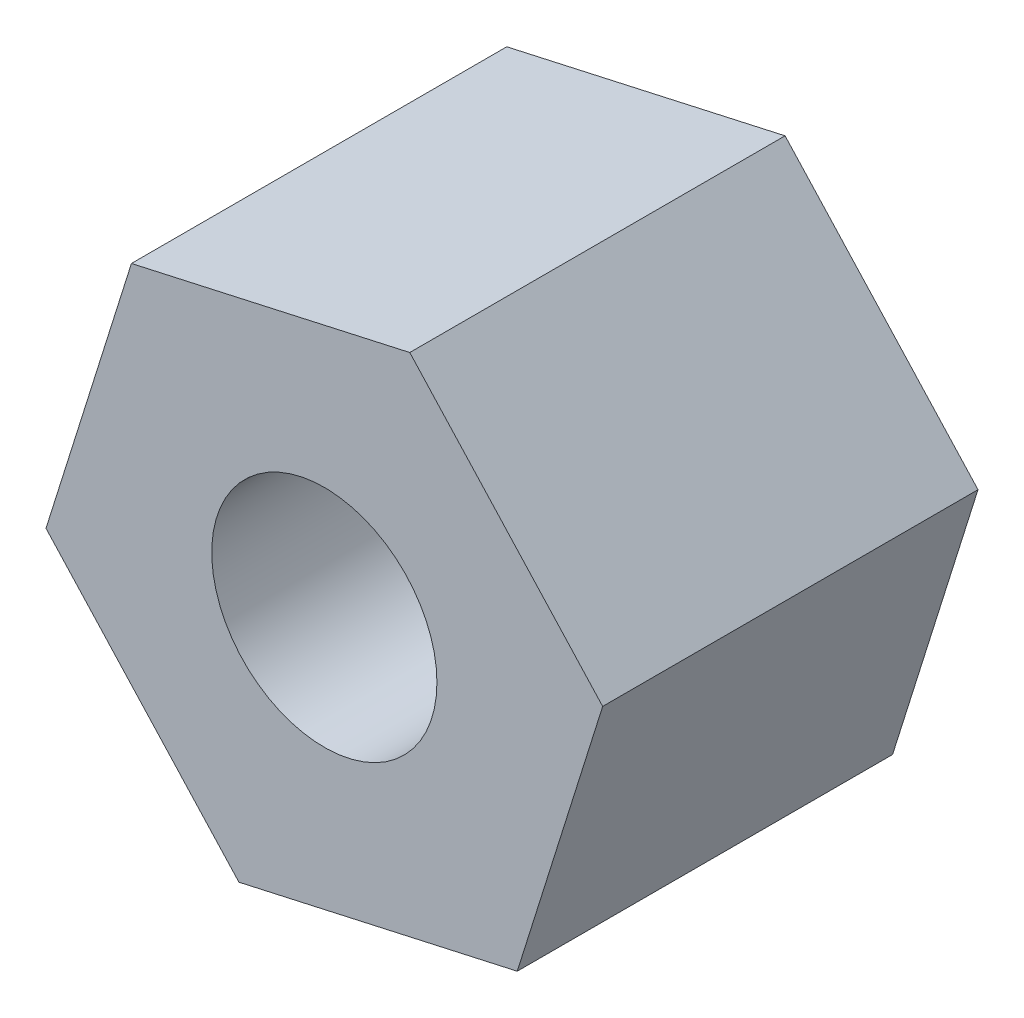
ISO-10303-21;
HEADER;
FILE_DESCRIPTION(('STEP AP214'),'2;1');
FILE_NAME('part.step','',(''),(''),'','','');
FILE_SCHEMA(('AUTOMOTIVE_DESIGN { 1 0 10303 214 1 1 1 1 }'));
ENDSEC;
DATA;
#1=APPLICATION_CONTEXT('core data for automotive mechanical design processes');
#2=APPLICATION_PROTOCOL_DEFINITION('international standard','automotive_design',2000,#1);
#3=PRODUCT_CONTEXT('',#1,'mechanical');
#4=PRODUCT('Part','Part','',(#3));
#5=PRODUCT_RELATED_PRODUCT_CATEGORY('part','',(#4));
#6=PRODUCT_DEFINITION_FORMATION('','',#4);
#7=PRODUCT_DEFINITION_CONTEXT('part definition',#1,'design');
#8=PRODUCT_DEFINITION('design','',#6,#7);
#9=PRODUCT_DEFINITION_SHAPE('','',#8);
#10=(LENGTH_UNIT() NAMED_UNIT(*) SI_UNIT(.MILLI.,.METRE.));
#11=(NAMED_UNIT(*) PLANE_ANGLE_UNIT() SI_UNIT($,.RADIAN.));
#12=(NAMED_UNIT(*) SI_UNIT($,.STERADIAN.) SOLID_ANGLE_UNIT());
#13=UNCERTAINTY_MEASURE_WITH_UNIT(LENGTH_MEASURE(1.E-05),#10,'distance_accuracy_value','');
#14=(GEOMETRIC_REPRESENTATION_CONTEXT(3) GLOBAL_UNCERTAINTY_ASSIGNED_CONTEXT((#13)) GLOBAL_UNIT_ASSIGNED_CONTEXT((#10,
#11,#12)) REPRESENTATION_CONTEXT('',''));
#15=CARTESIAN_POINT('',(0.,0.,0.));
#16=DIRECTION('',(0.,0.,1.));
#17=DIRECTION('',(1.,0.,0.));
#18=AXIS2_PLACEMENT_3D('',#15,#16,#17);
#19=CARTESIAN_POINT('',(0.,0.,5.));
#20=DIRECTION('',(0.,0.,1.));
#21=DIRECTION('',(1.,0.,0.));
#22=AXIS2_PLACEMENT_3D('',#19,#20,#21);
#23=PLANE('',#22);
#24=DIRECTION('',(-0.676465616289727,0.736474215419494,0.));
#25=VECTOR('',#24,1.);
#26=CARTESIAN_POINT('',(3.70793469135943,0.826652077930349,5.));
#27=LINE('',#26,#25);
#28=CARTESIAN_POINT('',(3.70793469135943,0.826652077930349,5.));
#29=VERTEX_POINT('',#28);
#30=CARTESIAN_POINT('',(1.13806564610084,3.62449167725606,5.));
#31=VERTEX_POINT('',#30);
#32=EDGE_CURVE('E146',#29,#31,#27,.T.);
#33=ORIENTED_EDGE('',*,*,#32,.T.);
#34=DIRECTION('',(-0.976038187930359,-0.217599300783853,0.));
#35=VECTOR('',#34,1.);
#36=CARTESIAN_POINT('',(1.13806564610084,3.62449167725606,5.));
#37=LINE('',#36,#35);
#38=CARTESIAN_POINT('',(-2.56986904525859,2.79783959932571,5.));
#39=VERTEX_POINT('',#38);
#40=EDGE_CURVE('E94',#31,#39,#37,.T.);
#41=ORIENTED_EDGE('',*,*,#40,.T.);
#42=DIRECTION('',(-0.299572571640632,-0.954073516203347,0.));
#43=VECTOR('',#42,1.);
#44=CARTESIAN_POINT('',(-2.56986904525859,2.79783959932571,5.));
#45=LINE('',#44,#43);
#46=CARTESIAN_POINT('',(-3.70793469135943,-0.826652077930349,5.));
#47=VERTEX_POINT('',#46);
#48=EDGE_CURVE('E107',#39,#47,#45,.T.);
#49=ORIENTED_EDGE('',*,*,#48,.T.);
#50=DIRECTION('',(0.676465616289727,-0.736474215419494,0.));
#51=VECTOR('',#50,1.);
#52=CARTESIAN_POINT('',(-3.70793469135943,-0.826652077930349,5.));
#53=LINE('',#52,#51);
#54=CARTESIAN_POINT('',(-1.13806564610084,-3.62449167725606,5.));
#55=VERTEX_POINT('',#54);
#56=EDGE_CURVE('E101',#47,#55,#53,.T.);
#57=ORIENTED_EDGE('',*,*,#56,.T.);
#58=DIRECTION('',(0.976038187930359,0.217599300783853,0.));
#59=VECTOR('',#58,1.);
#60=CARTESIAN_POINT('',(-1.13806564610084,-3.62449167725606,5.));
#61=LINE('',#60,#59);
#62=CARTESIAN_POINT('',(2.56986904525859,-2.79783959932571,5.));
#63=VERTEX_POINT('',#62);
#64=EDGE_CURVE('E105',#55,#63,#61,.T.);
#65=ORIENTED_EDGE('',*,*,#64,.T.);
#66=DIRECTION('',(0.299572571640632,0.954073516203347,0.));
#67=VECTOR('',#66,1.);
#68=CARTESIAN_POINT('',(2.56986904525859,-2.79783959932571,5.));
#69=LINE('',#68,#67);
#70=EDGE_CURVE('E57',#63,#29,#69,.T.);
#71=ORIENTED_EDGE('',*,*,#70,.T.);
#72=EDGE_LOOP('',(#33,#41,#49,#57,#65,#71));
#73=FACE_BOUND('',#72,.T.);
#74=CARTESIAN_POINT('',(0.,0.,5.));
#75=DIRECTION('',(0.,0.,1.));
#76=DIRECTION('',(1.,0.,0.));
#77=AXIS2_PLACEMENT_3D('',#74,#75,#76);
#78=CIRCLE('',#77,1.5);
#79=CARTESIAN_POINT('',(1.5,0.,5.));
#80=VERTEX_POINT('',#79);
#81=EDGE_CURVE('E134',#80,#80,#78,.T.);
#82=ORIENTED_EDGE('',*,*,#81,.F.);
#83=EDGE_LOOP('',(#82));
#84=FACE_BOUND('',#83,.T.);
#85=ADVANCED_FACE('F39',(#73,#84),#23,.T.);
#86=CARTESIAN_POINT('',(0.,0.,0.));
#87=DIRECTION('',(0.,0.,1.));
#88=DIRECTION('',(1.,0.,0.));
#89=AXIS2_PLACEMENT_3D('',#86,#87,#88);
#90=PLANE('',#89);
#91=DIRECTION('',(-0.676465616289727,0.736474215419494,0.));
#92=VECTOR('',#91,1.);
#93=CARTESIAN_POINT('',(3.70793469135943,0.826652077930349,0.));
#94=LINE('',#93,#92);
#95=CARTESIAN_POINT('',(3.70793469135943,0.826652077930349,0.));
#96=VERTEX_POINT('',#95);
#97=CARTESIAN_POINT('',(1.13806564610084,3.62449167725606,0.));
#98=VERTEX_POINT('',#97);
#99=EDGE_CURVE('E129',#96,#98,#94,.T.);
#100=ORIENTED_EDGE('',*,*,#99,.F.);
#101=DIRECTION('',(0.299572571640632,0.954073516203347,0.));
#102=VECTOR('',#101,1.);
#103=CARTESIAN_POINT('',(2.56986904525859,-2.79783959932571,0.));
#104=LINE('',#103,#102);
#105=CARTESIAN_POINT('',(2.56986904525859,-2.79783959932571,0.));
#106=VERTEX_POINT('',#105);
#107=EDGE_CURVE('E86',#106,#96,#104,.T.);
#108=ORIENTED_EDGE('',*,*,#107,.F.);
#109=DIRECTION('',(0.976038187930359,0.217599300783853,0.));
#110=VECTOR('',#109,1.);
#111=CARTESIAN_POINT('',(-1.13806564610084,-3.62449167725606,0.));
#112=LINE('',#111,#110);
#113=CARTESIAN_POINT('',(-1.13806564610084,-3.62449167725606,0.));
#114=VERTEX_POINT('',#113);
#115=EDGE_CURVE('E80',#114,#106,#112,.T.);
#116=ORIENTED_EDGE('',*,*,#115,.F.);
#117=DIRECTION('',(0.676465616289727,-0.736474215419494,0.));
#118=VECTOR('',#117,1.);
#119=CARTESIAN_POINT('',(-3.70793469135943,-0.826652077930349,0.));
#120=LINE('',#119,#118);
#121=CARTESIAN_POINT('',(-3.70793469135943,-0.826652077930349,0.));
#122=VERTEX_POINT('',#121);
#123=EDGE_CURVE('E116',#122,#114,#120,.T.);
#124=ORIENTED_EDGE('',*,*,#123,.F.);
#125=DIRECTION('',(-0.299572571640632,-0.954073516203347,0.));
#126=VECTOR('',#125,1.);
#127=CARTESIAN_POINT('',(-2.56986904525859,2.79783959932571,0.));
#128=LINE('',#127,#126);
#129=CARTESIAN_POINT('',(-2.56986904525859,2.79783959932571,0.));
#130=VERTEX_POINT('',#129);
#131=EDGE_CURVE('E137',#130,#122,#128,.T.);
#132=ORIENTED_EDGE('',*,*,#131,.F.);
#133=DIRECTION('',(-0.976038187930359,-0.217599300783853,0.));
#134=VECTOR('',#133,1.);
#135=CARTESIAN_POINT('',(1.13806564610084,3.62449167725606,0.));
#136=LINE('',#135,#134);
#137=EDGE_CURVE('E133',#98,#130,#136,.T.);
#138=ORIENTED_EDGE('',*,*,#137,.F.);
#139=EDGE_LOOP('',(#100,#108,#116,#124,#132,#138));
#140=FACE_BOUND('',#139,.T.);
#141=CARTESIAN_POINT('',(0.,0.,0.));
#142=DIRECTION('',(0.,0.,1.));
#143=DIRECTION('',(1.,0.,0.));
#144=AXIS2_PLACEMENT_3D('',#141,#142,#143);
#145=CIRCLE('',#144,1.5);
#146=CARTESIAN_POINT('',(1.5,0.,0.));
#147=VERTEX_POINT('',#146);
#148=EDGE_CURVE('E243',#147,#147,#145,.T.);
#149=ORIENTED_EDGE('',*,*,#148,.T.);
#150=EDGE_LOOP('',(#149));
#151=FACE_BOUND('',#150,.T.);
#152=ADVANCED_FACE('F159',(#140,#151),#90,.F.);
#153=CARTESIAN_POINT('',(3.70793469135943,0.826652077930349,5.));
#154=DIRECTION('',(-0.736474215419495,-0.676465616289727,0.));
#155=DIRECTION('',(0.676465616289727,-0.736474215419495,0.));
#156=AXIS2_PLACEMENT_3D('',#153,#154,#155);
#157=PLANE('',#156);
#158=ORIENTED_EDGE('',*,*,#99,.T.);
#159=DIRECTION('',(0.,0.,-1.));
#160=VECTOR('',#159,1.);
#161=CARTESIAN_POINT('',(1.13806564610084,3.62449167725606,5.));
#162=LINE('',#161,#160);
#163=EDGE_CURVE('E11',#31,#98,#162,.T.);
#164=ORIENTED_EDGE('',*,*,#163,.F.);
#165=ORIENTED_EDGE('',*,*,#32,.F.);
#166=DIRECTION('',(0.,0.,-1.));
#167=VECTOR('',#166,1.);
#168=CARTESIAN_POINT('',(3.70793469135943,0.826652077930349,5.));
#169=LINE('',#168,#167);
#170=EDGE_CURVE('E125',#29,#96,#169,.T.);
#171=ORIENTED_EDGE('',*,*,#170,.T.);
#172=EDGE_LOOP('',(#158,#164,#165,#171));
#173=FACE_BOUND('',#172,.T.);
#174=ADVANCED_FACE('F41',(#173),#157,.F.);
#175=CARTESIAN_POINT('',(1.13806564610084,3.62449167725606,5.));
#176=DIRECTION('',(0.217599300783853,-0.976038187930359,0.));
#177=DIRECTION('',(0.976038187930359,0.217599300783853,0.));
#178=AXIS2_PLACEMENT_3D('',#175,#176,#177);
#179=PLANE('',#178);
#180=ORIENTED_EDGE('',*,*,#137,.T.);
#181=DIRECTION('',(0.,0.,-1.));
#182=VECTOR('',#181,1.);
#183=CARTESIAN_POINT('',(-2.56986904525859,2.79783959932571,5.));
#184=LINE('',#183,#182);
#185=EDGE_CURVE('E49',#39,#130,#184,.T.);
#186=ORIENTED_EDGE('',*,*,#185,.F.);
#187=ORIENTED_EDGE('',*,*,#40,.F.);
#188=ORIENTED_EDGE('',*,*,#163,.T.);
#189=EDGE_LOOP('',(#180,#186,#187,#188));
#190=FACE_BOUND('',#189,.T.);
#191=ADVANCED_FACE('F184',(#190),#179,.F.);
#192=CARTESIAN_POINT('',(-2.56986904525859,2.79783959932571,5.));
#193=DIRECTION('',(0.954073516203347,-0.299572571640632,0.));
#194=DIRECTION('',(0.299572571640632,0.954073516203347,0.));
#195=AXIS2_PLACEMENT_3D('',#192,#193,#194);
#196=PLANE('',#195);
#197=ORIENTED_EDGE('',*,*,#131,.T.);
#198=DIRECTION('',(0.,0.,-1.));
#199=VECTOR('',#198,1.);
#200=CARTESIAN_POINT('',(-3.70793469135943,-0.826652077930349,5.));
#201=LINE('',#200,#199);
#202=EDGE_CURVE('E118',#47,#122,#201,.T.);
#203=ORIENTED_EDGE('',*,*,#202,.F.);
#204=ORIENTED_EDGE('',*,*,#48,.F.);
#205=ORIENTED_EDGE('',*,*,#185,.T.);
#206=EDGE_LOOP('',(#197,#203,#204,#205));
#207=FACE_BOUND('',#206,.T.);
#208=ADVANCED_FACE('F156',(#207),#196,.F.);
#209=CARTESIAN_POINT('',(-3.70793469135943,-0.826652077930349,5.));
#210=DIRECTION('',(0.736474215419494,0.676465616289727,0.));
#211=DIRECTION('',(-0.676465616289727,0.736474215419494,0.));
#212=AXIS2_PLACEMENT_3D('',#209,#210,#211);
#213=PLANE('',#212);
#214=ORIENTED_EDGE('',*,*,#123,.T.);
#215=DIRECTION('',(0.,0.,-1.));
#216=VECTOR('',#215,1.);
#217=CARTESIAN_POINT('',(-1.13806564610084,-3.62449167725606,5.));
#218=LINE('',#217,#216);
#219=EDGE_CURVE('E113',#55,#114,#218,.T.);
#220=ORIENTED_EDGE('',*,*,#219,.F.);
#221=ORIENTED_EDGE('',*,*,#56,.F.);
#222=ORIENTED_EDGE('',*,*,#202,.T.);
#223=EDGE_LOOP('',(#214,#220,#221,#222));
#224=FACE_BOUND('',#223,.T.);
#225=ADVANCED_FACE('F114',(#224),#213,.F.);
#226=CARTESIAN_POINT('',(-1.13806564610084,-3.62449167725606,5.));
#227=DIRECTION('',(-0.217599300783853,0.976038187930359,0.));
#228=DIRECTION('',(-0.976038187930359,-0.217599300783853,0.));
#229=AXIS2_PLACEMENT_3D('',#226,#227,#228);
#230=PLANE('',#229);
#231=ORIENTED_EDGE('',*,*,#115,.T.);
#232=DIRECTION('',(0.,0.,-1.));
#233=VECTOR('',#232,1.);
#234=CARTESIAN_POINT('',(2.56986904525859,-2.79783959932571,5.));
#235=LINE('',#234,#233);
#236=EDGE_CURVE('E119',#63,#106,#235,.T.);
#237=ORIENTED_EDGE('',*,*,#236,.F.);
#238=ORIENTED_EDGE('',*,*,#64,.F.);
#239=ORIENTED_EDGE('',*,*,#219,.T.);
#240=EDGE_LOOP('',(#231,#237,#238,#239));
#241=FACE_BOUND('',#240,.T.);
#242=ADVANCED_FACE('F121',(#241),#230,.F.);
#243=CARTESIAN_POINT('',(2.56986904525859,-2.79783959932571,5.));
#244=DIRECTION('',(-0.954073516203347,0.299572571640632,0.));
#245=DIRECTION('',(-0.299572571640633,-0.954073516203347,0.));
#246=AXIS2_PLACEMENT_3D('',#243,#244,#245);
#247=PLANE('',#246);
#248=ORIENTED_EDGE('',*,*,#107,.T.);
#249=ORIENTED_EDGE('',*,*,#170,.F.);
#250=ORIENTED_EDGE('',*,*,#70,.F.);
#251=ORIENTED_EDGE('',*,*,#236,.T.);
#252=EDGE_LOOP('',(#248,#249,#250,#251));
#253=FACE_BOUND('',#252,.T.);
#254=ADVANCED_FACE('F164',(#253),#247,.F.);
#255=CARTESIAN_POINT('',(0.,0.,5.));
#256=DIRECTION('',(0.,0.,-1.));
#257=DIRECTION('',(-1.,0.,0.));
#258=AXIS2_PLACEMENT_3D('',#255,#256,#257);
#259=CYLINDRICAL_SURFACE('',#258,1.5);
#260=ORIENTED_EDGE('',*,*,#81,.T.);
#261=EDGE_LOOP('',(#260));
#262=FACE_BOUND('',#261,.T.);
#263=ORIENTED_EDGE('',*,*,#148,.F.);
#264=EDGE_LOOP('',(#263));
#265=FACE_BOUND('',#264,.T.);
#266=ADVANCED_FACE('F166',(#262,#265),#259,.F.);
#267=CLOSED_SHELL('',(#85,#152,#174,#191,#208,#225,#242,#254,#266));
#268=MANIFOLD_SOLID_BREP('B2',#267);
#269=ADVANCED_BREP_SHAPE_REPRESENTATION('',(#18,#268),#14);
#270=SHAPE_DEFINITION_REPRESENTATION(#9,#269);
ENDSEC;
END-ISO-10303-21;
